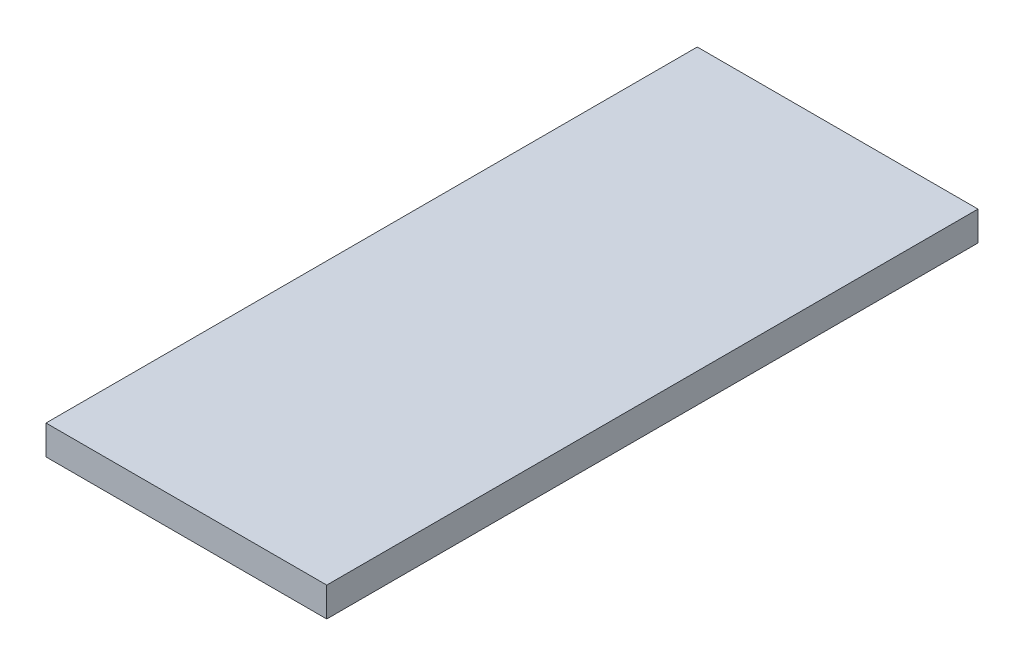
ISO-10303-21;
HEADER;
FILE_DESCRIPTION(('STEP AP214'),'2;1');
FILE_NAME('part.step','',(''),(''),'','','');
FILE_SCHEMA(('AUTOMOTIVE_DESIGN { 1 0 10303 214 1 1 1 1 }'));
ENDSEC;
DATA;
#1=APPLICATION_CONTEXT('core data for automotive mechanical design processes');
#2=APPLICATION_PROTOCOL_DEFINITION('international standard','automotive_design',2000,#1);
#3=PRODUCT_CONTEXT('',#1,'mechanical');
#4=PRODUCT('Part','Part','',(#3));
#5=PRODUCT_RELATED_PRODUCT_CATEGORY('part','',(#4));
#6=PRODUCT_DEFINITION_FORMATION('','',#4);
#7=PRODUCT_DEFINITION_CONTEXT('part definition',#1,'design');
#8=PRODUCT_DEFINITION('design','',#6,#7);
#9=PRODUCT_DEFINITION_SHAPE('','',#8);
#10=(LENGTH_UNIT() NAMED_UNIT(*) SI_UNIT(.MILLI.,.METRE.));
#11=(NAMED_UNIT(*) PLANE_ANGLE_UNIT() SI_UNIT($,.RADIAN.));
#12=(NAMED_UNIT(*) SI_UNIT($,.STERADIAN.) SOLID_ANGLE_UNIT());
#13=UNCERTAINTY_MEASURE_WITH_UNIT(LENGTH_MEASURE(1.E-05),#10,'distance_accuracy_value','');
#14=(GEOMETRIC_REPRESENTATION_CONTEXT(3) GLOBAL_UNCERTAINTY_ASSIGNED_CONTEXT((#13)) GLOBAL_UNIT_ASSIGNED_CONTEXT((#10,
#11,#12)) REPRESENTATION_CONTEXT('',''));
#15=CARTESIAN_POINT('',(0.,0.,0.));
#16=DIRECTION('',(0.,0.,1.));
#17=DIRECTION('',(1.,0.,0.));
#18=AXIS2_PLACEMENT_3D('',#15,#16,#17);
#19=CARTESIAN_POINT('',(0.,2.54,0.));
#20=DIRECTION('',(1.,0.,0.));
#21=DIRECTION('',(0.,0.,-1.));
#22=AXIS2_PLACEMENT_3D('',#19,#20,#21);
#23=PLANE('',#22);
#24=DIRECTION('',(0.,0.,1.));
#25=VECTOR('',#24,1.);
#26=CARTESIAN_POINT('',(0.,0.,0.));
#27=LINE('',#26,#25);
#28=CARTESIAN_POINT('',(0.,0.,-56.2737));
#29=VERTEX_POINT('',#28);
#30=CARTESIAN_POINT('',(0.,0.,0.));
#31=VERTEX_POINT('',#30);
#32=EDGE_CURVE('E95',#29,#31,#27,.T.);
#33=ORIENTED_EDGE('',*,*,#32,.T.);
#34=DIRECTION('',(0.,-1.,0.));
#35=VECTOR('',#34,1.);
#36=CARTESIAN_POINT('',(0.,2.54,0.));
#37=LINE('',#36,#35);
#38=CARTESIAN_POINT('',(0.,2.54,0.));
#39=VERTEX_POINT('',#38);
#40=EDGE_CURVE('E11',#39,#31,#37,.T.);
#41=ORIENTED_EDGE('',*,*,#40,.F.);
#42=DIRECTION('',(0.,0.,1.));
#43=VECTOR('',#42,1.);
#44=CARTESIAN_POINT('',(0.,2.54,0.));
#45=LINE('',#44,#43);
#46=CARTESIAN_POINT('',(0.,2.54,-56.2737));
#47=VERTEX_POINT('',#46);
#48=EDGE_CURVE('E83',#47,#39,#45,.T.);
#49=ORIENTED_EDGE('',*,*,#48,.F.);
#50=DIRECTION('',(0.,-1.,0.));
#51=VECTOR('',#50,1.);
#52=CARTESIAN_POINT('',(0.,2.54,-56.2737));
#53=LINE('',#52,#51);
#54=EDGE_CURVE('E91',#47,#29,#53,.T.);
#55=ORIENTED_EDGE('',*,*,#54,.T.);
#56=EDGE_LOOP('',(#33,#41,#49,#55));
#57=FACE_BOUND('',#56,.T.);
#58=ADVANCED_FACE('F32',(#57),#23,.F.);
#59=CARTESIAN_POINT('',(0.,2.54,0.));
#60=DIRECTION('',(0.,0.,-1.));
#61=DIRECTION('',(-1.,0.,0.));
#62=AXIS2_PLACEMENT_3D('',#59,#60,#61);
#63=PLANE('',#62);
#64=DIRECTION('',(1.,0.,0.));
#65=VECTOR('',#64,1.);
#66=CARTESIAN_POINT('',(0.,0.,0.));
#67=LINE('',#66,#65);
#68=CARTESIAN_POINT('',(24.257,0.,0.));
#69=VERTEX_POINT('',#68);
#70=EDGE_CURVE('E87',#31,#69,#67,.T.);
#71=ORIENTED_EDGE('',*,*,#70,.T.);
#72=DIRECTION('',(0.,-1.,0.));
#73=VECTOR('',#72,1.);
#74=CARTESIAN_POINT('',(24.257,2.54,0.));
#75=LINE('',#74,#73);
#76=CARTESIAN_POINT('',(24.257,2.54,0.));
#77=VERTEX_POINT('',#76);
#78=EDGE_CURVE('E40',#77,#69,#75,.T.);
#79=ORIENTED_EDGE('',*,*,#78,.F.);
#80=DIRECTION('',(1.,0.,0.));
#81=VECTOR('',#80,1.);
#82=CARTESIAN_POINT('',(0.,2.54,0.));
#83=LINE('',#82,#81);
#84=EDGE_CURVE('E78',#39,#77,#83,.T.);
#85=ORIENTED_EDGE('',*,*,#84,.F.);
#86=ORIENTED_EDGE('',*,*,#40,.T.);
#87=EDGE_LOOP('',(#71,#79,#85,#86));
#88=FACE_BOUND('',#87,.T.);
#89=ADVANCED_FACE('F86',(#88),#63,.F.);
#90=CARTESIAN_POINT('',(24.257,2.54,0.));
#91=DIRECTION('',(-1.,0.,0.));
#92=DIRECTION('',(0.,0.,1.));
#93=AXIS2_PLACEMENT_3D('',#90,#91,#92);
#94=PLANE('',#93);
#95=DIRECTION('',(0.,0.,-1.));
#96=VECTOR('',#95,1.);
#97=CARTESIAN_POINT('',(24.257,0.,0.));
#98=LINE('',#97,#96);
#99=CARTESIAN_POINT('',(24.257,0.,-56.2737));
#100=VERTEX_POINT('',#99);
#101=EDGE_CURVE('E65',#69,#100,#98,.T.);
#102=ORIENTED_EDGE('',*,*,#101,.T.);
#103=DIRECTION('',(0.,-1.,0.));
#104=VECTOR('',#103,1.);
#105=CARTESIAN_POINT('',(24.257,2.54,-56.2737));
#106=LINE('',#105,#104);
#107=CARTESIAN_POINT('',(24.257,2.54,-56.2737));
#108=VERTEX_POINT('',#107);
#109=EDGE_CURVE('E88',#108,#100,#106,.T.);
#110=ORIENTED_EDGE('',*,*,#109,.F.);
#111=DIRECTION('',(0.,0.,-1.));
#112=VECTOR('',#111,1.);
#113=CARTESIAN_POINT('',(24.257,2.54,0.));
#114=LINE('',#113,#112);
#115=EDGE_CURVE('E81',#77,#108,#114,.T.);
#116=ORIENTED_EDGE('',*,*,#115,.F.);
#117=ORIENTED_EDGE('',*,*,#78,.T.);
#118=EDGE_LOOP('',(#102,#110,#116,#117));
#119=FACE_BOUND('',#118,.T.);
#120=ADVANCED_FACE('F89',(#119),#94,.F.);
#121=CARTESIAN_POINT('',(0.,2.54,-56.2737));
#122=DIRECTION('',(0.,0.,1.));
#123=DIRECTION('',(1.,0.,0.));
#124=AXIS2_PLACEMENT_3D('',#121,#122,#123);
#125=PLANE('',#124);
#126=DIRECTION('',(-1.,0.,0.));
#127=VECTOR('',#126,1.);
#128=CARTESIAN_POINT('',(0.,0.,-56.2737));
#129=LINE('',#128,#127);
#130=EDGE_CURVE('E71',#100,#29,#129,.T.);
#131=ORIENTED_EDGE('',*,*,#130,.T.);
#132=ORIENTED_EDGE('',*,*,#54,.F.);
#133=DIRECTION('',(-1.,0.,0.));
#134=VECTOR('',#133,1.);
#135=CARTESIAN_POINT('',(0.,2.54,-56.2737));
#136=LINE('',#135,#134);
#137=EDGE_CURVE('E48',#108,#47,#136,.T.);
#138=ORIENTED_EDGE('',*,*,#137,.F.);
#139=ORIENTED_EDGE('',*,*,#109,.T.);
#140=EDGE_LOOP('',(#131,#132,#138,#139));
#141=FACE_BOUND('',#140,.T.);
#142=ADVANCED_FACE('F102',(#141),#125,.F.);
#143=CARTESIAN_POINT('',(0.,2.54,0.));
#144=DIRECTION('',(0.,-1.,0.));
#145=DIRECTION('',(0.,0.,-1.));
#146=AXIS2_PLACEMENT_3D('',#143,#144,#145);
#147=PLANE('',#146);
#148=ORIENTED_EDGE('',*,*,#48,.T.);
#149=ORIENTED_EDGE('',*,*,#84,.T.);
#150=ORIENTED_EDGE('',*,*,#115,.T.);
#151=ORIENTED_EDGE('',*,*,#137,.T.);
#152=EDGE_LOOP('',(#148,#149,#150,#151));
#153=FACE_BOUND('',#152,.T.);
#154=ADVANCED_FACE('F79',(#153),#147,.F.);
#155=CARTESIAN_POINT('',(0.,0.,0.));
#156=DIRECTION('',(0.,-1.,0.));
#157=DIRECTION('',(0.,0.,-1.));
#158=AXIS2_PLACEMENT_3D('',#155,#156,#157);
#159=PLANE('',#158);
#160=ORIENTED_EDGE('',*,*,#32,.F.);
#161=ORIENTED_EDGE('',*,*,#130,.F.);
#162=ORIENTED_EDGE('',*,*,#101,.F.);
#163=ORIENTED_EDGE('',*,*,#70,.F.);
#164=EDGE_LOOP('',(#160,#161,#162,#163));
#165=FACE_BOUND('',#164,.T.);
#166=ADVANCED_FACE('F105',(#165),#159,.T.);
#167=CLOSED_SHELL('',(#58,#89,#120,#142,#154,#166));
#168=MANIFOLD_SOLID_BREP('B2',#167);
#169=ADVANCED_BREP_SHAPE_REPRESENTATION('',(#18,#168),#14);
#170=SHAPE_DEFINITION_REPRESENTATION(#9,#169);
ENDSEC;
END-ISO-10303-21;
